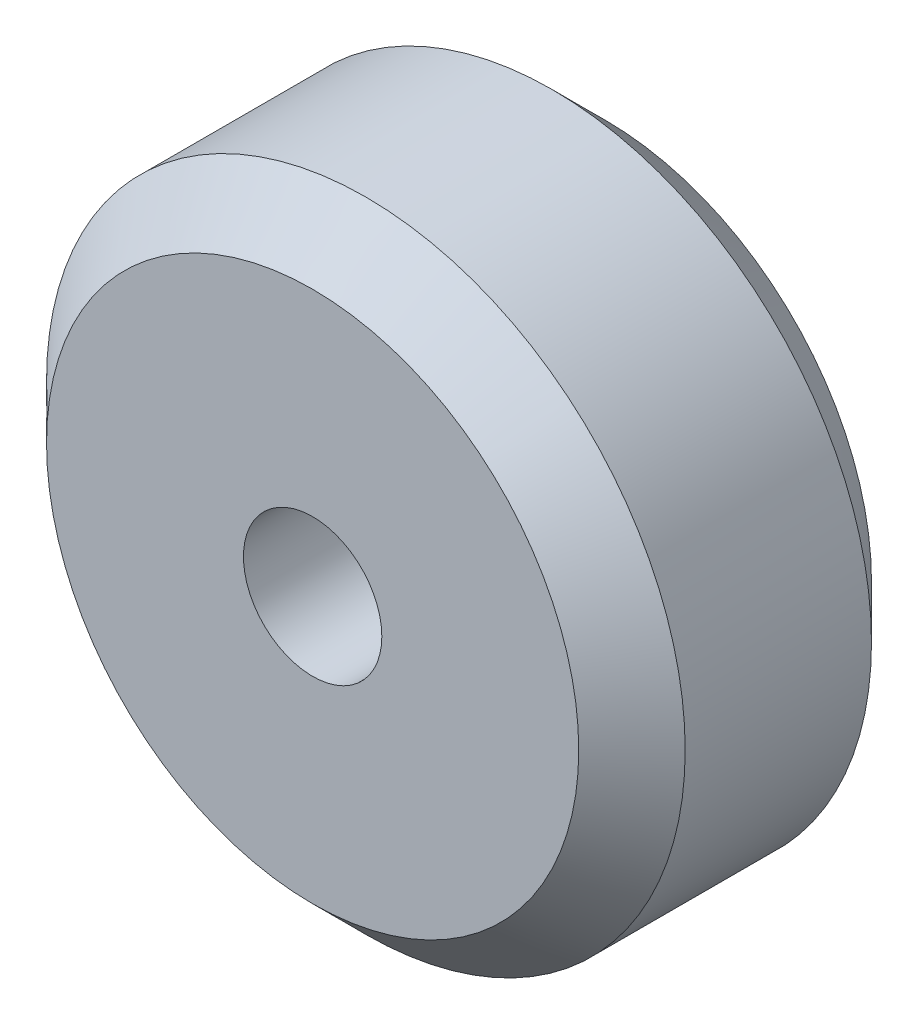
ISO-10303-21;
HEADER;
FILE_DESCRIPTION(('STEP AP214'),'2;1');
FILE_NAME('part.step','',(''),(''),'','','');
FILE_SCHEMA(('AUTOMOTIVE_DESIGN { 1 0 10303 214 1 1 1 1 }'));
ENDSEC;
DATA;
#1=APPLICATION_CONTEXT('core data for automotive mechanical design processes');
#2=APPLICATION_PROTOCOL_DEFINITION('international standard','automotive_design',2000,#1);
#3=PRODUCT_CONTEXT('',#1,'mechanical');
#4=PRODUCT('Part','Part','',(#3));
#5=PRODUCT_RELATED_PRODUCT_CATEGORY('part','',(#4));
#6=PRODUCT_DEFINITION_FORMATION('','',#4);
#7=PRODUCT_DEFINITION_CONTEXT('part definition',#1,'design');
#8=PRODUCT_DEFINITION('design','',#6,#7);
#9=PRODUCT_DEFINITION_SHAPE('','',#8);
#10=(LENGTH_UNIT() NAMED_UNIT(*) SI_UNIT(.MILLI.,.METRE.));
#11=(NAMED_UNIT(*) PLANE_ANGLE_UNIT() SI_UNIT($,.RADIAN.));
#12=(NAMED_UNIT(*) SI_UNIT($,.STERADIAN.) SOLID_ANGLE_UNIT());
#13=UNCERTAINTY_MEASURE_WITH_UNIT(LENGTH_MEASURE(1.E-05),#10,'distance_accuracy_value','');
#14=(GEOMETRIC_REPRESENTATION_CONTEXT(3) GLOBAL_UNCERTAINTY_ASSIGNED_CONTEXT((#13)) GLOBAL_UNIT_ASSIGNED_CONTEXT((#10,
#11,#12)) REPRESENTATION_CONTEXT('',''));
#15=CARTESIAN_POINT('',(0.,0.,0.));
#16=DIRECTION('',(0.,0.,1.));
#17=DIRECTION('',(1.,0.,0.));
#18=AXIS2_PLACEMENT_3D('',#15,#16,#17);
#19=CARTESIAN_POINT('',(0.,0.,11.));
#20=DIRECTION('',(0.,0.,-1.));
#21=DIRECTION('',(-1.,0.,0.));
#22=AXIS2_PLACEMENT_3D('',#19,#20,#21);
#23=CYLINDRICAL_SURFACE('',#22,12.);
#24=CARTESIAN_POINT('',(0.,0.,2.));
#25=DIRECTION('',(0.,0.,1.));
#26=DIRECTION('',(1.,0.,0.));
#27=AXIS2_PLACEMENT_3D('',#24,#25,#26);
#28=CIRCLE('',#27,12.);
#29=CARTESIAN_POINT('',(12.,0.,2.));
#30=VERTEX_POINT('',#29);
#31=EDGE_CURVE('E57',#30,#30,#28,.T.);
#32=ORIENTED_EDGE('',*,*,#31,.T.);
#33=EDGE_LOOP('',(#32));
#34=FACE_BOUND('',#33,.T.);
#35=CARTESIAN_POINT('',(0.,0.,9.));
#36=DIRECTION('',(0.,0.,1.));
#37=DIRECTION('',(1.,0.,0.));
#38=AXIS2_PLACEMENT_3D('',#35,#36,#37);
#39=CIRCLE('',#38,12.);
#40=CARTESIAN_POINT('',(12.,0.,9.));
#41=VERTEX_POINT('',#40);
#42=EDGE_CURVE('E61',#41,#41,#39,.F.);
#43=ORIENTED_EDGE('',*,*,#42,.T.);
#44=EDGE_LOOP('',(#43));
#45=FACE_BOUND('',#44,.T.);
#46=ADVANCED_FACE('F45',(#34,#45),#23,.T.);
#47=CARTESIAN_POINT('',(0.,0.,11.));
#48=DIRECTION('',(0.,0.,1.));
#49=DIRECTION('',(1.,0.,0.));
#50=AXIS2_PLACEMENT_3D('',#47,#48,#49);
#51=PLANE('',#50);
#52=CARTESIAN_POINT('',(0.,0.,11.));
#53=DIRECTION('',(0.,0.,1.));
#54=DIRECTION('',(1.,0.,0.));
#55=AXIS2_PLACEMENT_3D('',#52,#53,#54);
#56=CIRCLE('',#55,2.6);
#57=CARTESIAN_POINT('',(2.6,0.,11.));
#58=VERTEX_POINT('',#57);
#59=EDGE_CURVE('E69',#58,#58,#56,.T.);
#60=ORIENTED_EDGE('',*,*,#59,.F.);
#61=EDGE_LOOP('',(#60));
#62=FACE_BOUND('',#61,.T.);
#63=CARTESIAN_POINT('',(0.,0.,11.));
#64=DIRECTION('',(0.,0.,1.));
#65=DIRECTION('',(1.,0.,0.));
#66=AXIS2_PLACEMENT_3D('',#63,#64,#65);
#67=CIRCLE('',#66,10.);
#68=CARTESIAN_POINT('',(10.,0.,11.));
#69=VERTEX_POINT('',#68);
#70=EDGE_CURVE('E10',#69,#69,#67,.T.);
#71=ORIENTED_EDGE('',*,*,#70,.T.);
#72=EDGE_LOOP('',(#71));
#73=FACE_BOUND('',#72,.T.);
#74=ADVANCED_FACE('F75',(#62,#73),#51,.T.);
#75=CARTESIAN_POINT('',(0.,0.,0.));
#76=DIRECTION('',(0.,0.,1.));
#77=DIRECTION('',(1.,0.,0.));
#78=AXIS2_PLACEMENT_3D('',#75,#76,#77);
#79=PLANE('',#78);
#80=CARTESIAN_POINT('',(0.,0.,0.));
#81=DIRECTION('',(0.,0.,1.));
#82=DIRECTION('',(1.,0.,0.));
#83=AXIS2_PLACEMENT_3D('',#80,#81,#82);
#84=CIRCLE('',#83,2.6);
#85=CARTESIAN_POINT('',(2.6,0.,0.));
#86=VERTEX_POINT('',#85);
#87=EDGE_CURVE('E66',#86,#86,#84,.F.);
#88=ORIENTED_EDGE('',*,*,#87,.F.);
#89=EDGE_LOOP('',(#88));
#90=FACE_BOUND('',#89,.T.);
#91=CARTESIAN_POINT('',(0.,0.,0.));
#92=DIRECTION('',(0.,0.,1.));
#93=DIRECTION('',(1.,0.,0.));
#94=AXIS2_PLACEMENT_3D('',#91,#92,#93);
#95=CIRCLE('',#94,9.99999999999999);
#96=CARTESIAN_POINT('',(9.99999999999999,0.,0.));
#97=VERTEX_POINT('',#96);
#98=EDGE_CURVE('E53',#97,#97,#95,.F.);
#99=ORIENTED_EDGE('',*,*,#98,.T.);
#100=EDGE_LOOP('',(#99));
#101=FACE_BOUND('',#100,.T.);
#102=ADVANCED_FACE('F77',(#90,#101),#79,.F.);
#103=CARTESIAN_POINT('',(0.,0.,2.));
#104=DIRECTION('',(0.,0.,1.));
#105=DIRECTION('',(1.,0.,0.));
#106=AXIS2_PLACEMENT_3D('',#103,#104,#105);
#107=CONICAL_SURFACE('',#106,12.,0.78539816339745);
#108=ORIENTED_EDGE('',*,*,#98,.F.);
#109=EDGE_LOOP('',(#108));
#110=FACE_BOUND('',#109,.T.);
#111=ORIENTED_EDGE('',*,*,#31,.F.);
#112=EDGE_LOOP('',(#111));
#113=FACE_BOUND('',#112,.T.);
#114=ADVANCED_FACE('F83',(#110,#113),#107,.T.);
#115=CARTESIAN_POINT('',(0.,0.,11.));
#116=DIRECTION('',(0.,0.,-1.));
#117=DIRECTION('',(-1.,0.,0.));
#118=AXIS2_PLACEMENT_3D('',#115,#116,#117);
#119=CONICAL_SURFACE('',#118,10.,0.785398163397446);
#120=ORIENTED_EDGE('',*,*,#42,.F.);
#121=EDGE_LOOP('',(#120));
#122=FACE_BOUND('',#121,.T.);
#123=ORIENTED_EDGE('',*,*,#70,.F.);
#124=EDGE_LOOP('',(#123));
#125=FACE_BOUND('',#124,.T.);
#126=ADVANCED_FACE('F48',(#122,#125),#119,.T.);
#127=CARTESIAN_POINT('',(0.,0.,-7.35391052434009));
#128=DIRECTION('',(0.,0.,1.));
#129=DIRECTION('',(1.,0.,0.));
#130=AXIS2_PLACEMENT_3D('',#127,#128,#129);
#131=CYLINDRICAL_SURFACE('',#130,2.6);
#132=ORIENTED_EDGE('',*,*,#87,.T.);
#133=EDGE_LOOP('',(#132));
#134=FACE_BOUND('',#133,.T.);
#135=ORIENTED_EDGE('',*,*,#59,.T.);
#136=EDGE_LOOP('',(#135));
#137=FACE_BOUND('',#136,.T.);
#138=ADVANCED_FACE('F73',(#134,#137),#131,.F.);
#139=CLOSED_SHELL('',(#46,#74,#102,#114,#126,#138));
#140=MANIFOLD_SOLID_BREP('B2',#139);
#141=ADVANCED_BREP_SHAPE_REPRESENTATION('',(#18,#140),#14);
#142=SHAPE_DEFINITION_REPRESENTATION(#9,#141);
ENDSEC;
END-ISO-10303-21;
